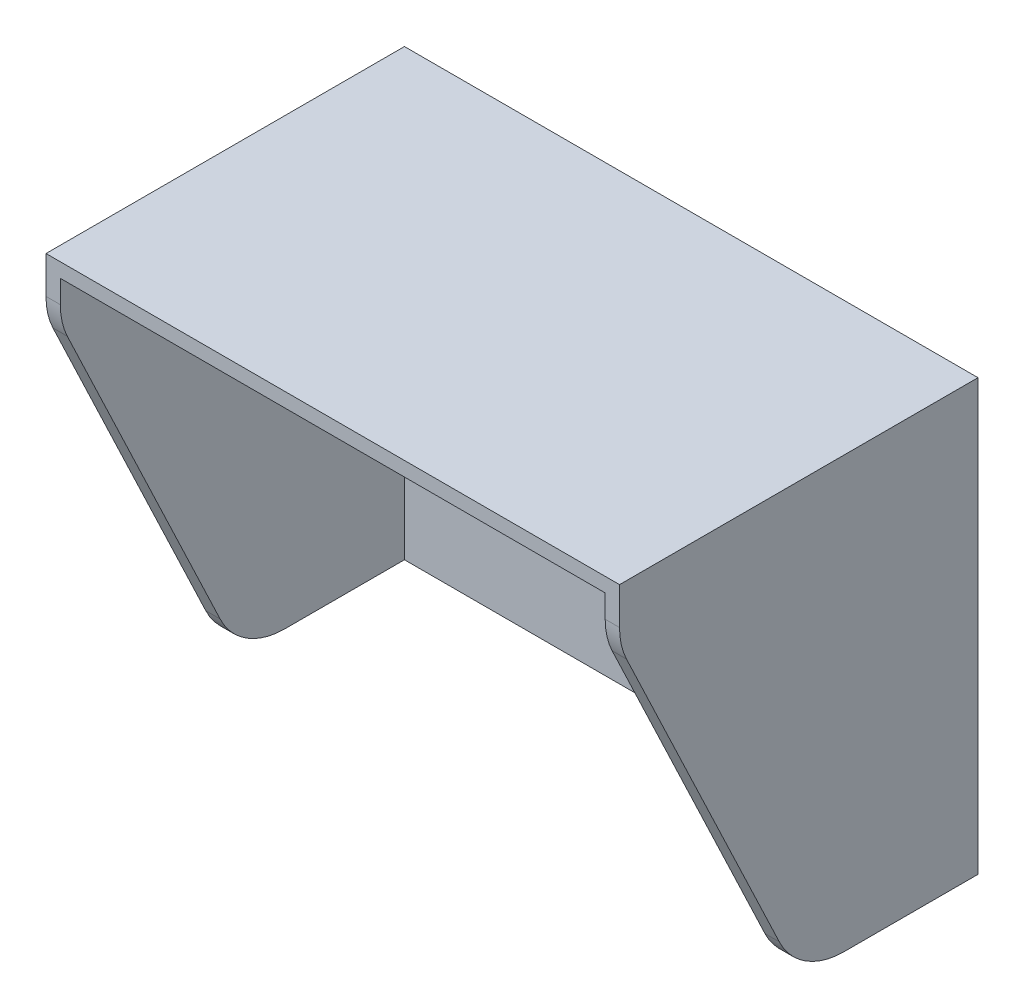
ISO-10303-21;
HEADER;
FILE_DESCRIPTION(('STEP AP214'),'2;1');
FILE_NAME('part.step','',(''),(''),'','','');
FILE_SCHEMA(('AUTOMOTIVE_DESIGN { 1 0 10303 214 1 1 1 1 }'));
ENDSEC;
DATA;
#1=APPLICATION_CONTEXT('core data for automotive mechanical design processes');
#2=APPLICATION_PROTOCOL_DEFINITION('international standard','automotive_design',2000,#1);
#3=PRODUCT_CONTEXT('',#1,'mechanical');
#4=PRODUCT('Part','Part','',(#3));
#5=PRODUCT_RELATED_PRODUCT_CATEGORY('part','',(#4));
#6=PRODUCT_DEFINITION_FORMATION('','',#4);
#7=PRODUCT_DEFINITION_CONTEXT('part definition',#1,'design');
#8=PRODUCT_DEFINITION('design','',#6,#7);
#9=PRODUCT_DEFINITION_SHAPE('','',#8);
#10=(LENGTH_UNIT() NAMED_UNIT(*) SI_UNIT(.MILLI.,.METRE.));
#11=(NAMED_UNIT(*) PLANE_ANGLE_UNIT() SI_UNIT($,.RADIAN.));
#12=(NAMED_UNIT(*) SI_UNIT($,.STERADIAN.) SOLID_ANGLE_UNIT());
#13=UNCERTAINTY_MEASURE_WITH_UNIT(LENGTH_MEASURE(1.E-05),#10,'distance_accuracy_value','');
#14=(GEOMETRIC_REPRESENTATION_CONTEXT(3) GLOBAL_UNCERTAINTY_ASSIGNED_CONTEXT((#13)) GLOBAL_UNIT_ASSIGNED_CONTEXT((#10,
#11,#12)) REPRESENTATION_CONTEXT('',''));
#15=CARTESIAN_POINT('',(0.,0.,0.));
#16=DIRECTION('',(0.,0.,1.));
#17=DIRECTION('',(1.,0.,0.));
#18=AXIS2_PLACEMENT_3D('',#15,#16,#17);
#19=CARTESIAN_POINT('',(0.,0.,50.));
#20=DIRECTION('',(0.,0.,1.));
#21=DIRECTION('',(1.,0.,0.));
#22=AXIS2_PLACEMENT_3D('',#19,#20,#21);
#23=PLANE('',#22);
#24=DIRECTION('',(0.,1.,0.));
#25=VECTOR('',#24,1.);
#26=CARTESIAN_POINT('',(29.0064520376589,-21.6961946145236,50.));
#27=LINE('',#26,#25);
#28=CARTESIAN_POINT('',(29.0064520376589,33.1212483638672,50.));
#29=VERTEX_POINT('',#28);
#30=CARTESIAN_POINT('',(29.0064520376589,36.3038053854764,50.));
#31=VERTEX_POINT('',#30);
#32=EDGE_CURVE('E313',#29,#31,#27,.T.);
#33=ORIENTED_EDGE('',*,*,#32,.F.);
#34=DIRECTION('',(-1.,0.,0.));
#35=VECTOR('',#34,1.);
#36=CARTESIAN_POINT('',(31.0064520376589,33.1212483638672,50.));
#37=LINE('',#36,#35);
#38=CARTESIAN_POINT('',(31.0064520376588,33.1212483638672,50.));
#39=VERTEX_POINT('',#38);
#40=EDGE_CURVE('E256',#29,#39,#37,.F.);
#41=ORIENTED_EDGE('',*,*,#40,.T.);
#42=DIRECTION('',(0.,1.,0.));
#43=VECTOR('',#42,1.);
#44=CARTESIAN_POINT('',(31.0064520376588,38.3038053854764,50.));
#45=LINE('',#44,#43);
#46=CARTESIAN_POINT('',(31.0064520376588,38.3038053854764,50.));
#47=VERTEX_POINT('',#46);
#48=EDGE_CURVE('E201',#39,#47,#45,.T.);
#49=ORIENTED_EDGE('',*,*,#48,.T.);
#50=DIRECTION('',(-1.,0.,0.));
#51=VECTOR('',#50,1.);
#52=CARTESIAN_POINT('',(-48.9935479623412,38.3038053854764,50.));
#53=LINE('',#52,#51);
#54=CARTESIAN_POINT('',(-48.9935479623412,38.3038053854764,50.));
#55=VERTEX_POINT('',#54);
#56=EDGE_CURVE('E205',#47,#55,#53,.T.);
#57=ORIENTED_EDGE('',*,*,#56,.T.);
#58=DIRECTION('',(0.,-1.,0.));
#59=VECTOR('',#58,1.);
#60=CARTESIAN_POINT('',(-48.9935479623412,38.3038053854764,50.));
#61=LINE('',#60,#59);
#62=CARTESIAN_POINT('',(-48.9935479623412,33.1212483638672,50.));
#63=VERTEX_POINT('',#62);
#64=EDGE_CURVE('E197',#55,#63,#61,.T.);
#65=ORIENTED_EDGE('',*,*,#64,.T.);
#66=DIRECTION('',(-1.,0.,0.));
#67=VECTOR('',#66,1.);
#68=CARTESIAN_POINT('',(-46.9935479623412,33.1212483638672,50.));
#69=LINE('',#68,#67);
#70=CARTESIAN_POINT('',(-46.9935479623412,33.1212483638672,50.));
#71=VERTEX_POINT('',#70);
#72=EDGE_CURVE('E253',#63,#71,#69,.F.);
#73=ORIENTED_EDGE('',*,*,#72,.T.);
#74=DIRECTION('',(0.,-1.,0.));
#75=VECTOR('',#74,1.);
#76=CARTESIAN_POINT('',(-46.9935479623412,-21.6961946145236,50.));
#77=LINE('',#76,#75);
#78=CARTESIAN_POINT('',(-46.9935479623412,36.3038053854764,50.));
#79=VERTEX_POINT('',#78);
#80=EDGE_CURVE('E321',#79,#71,#77,.T.);
#81=ORIENTED_EDGE('',*,*,#80,.F.);
#82=DIRECTION('',(-1.,0.,0.));
#83=VECTOR('',#82,1.);
#84=CARTESIAN_POINT('',(-46.9935479623412,36.3038053854764,50.));
#85=LINE('',#84,#83);
#86=EDGE_CURVE('E319',#31,#79,#85,.T.);
#87=ORIENTED_EDGE('',*,*,#86,.F.);
#88=EDGE_LOOP('',(#33,#41,#49,#57,#65,#73,#81,#87));
#89=FACE_BOUND('',#88,.T.);
#90=ADVANCED_FACE('F43',(#89),#23,.T.);
#91=CARTESIAN_POINT('',(0.,0.,0.));
#92=DIRECTION('',(0.,0.,1.));
#93=DIRECTION('',(1.,0.,0.));
#94=AXIS2_PLACEMENT_3D('',#91,#92,#93);
#95=PLANE('',#94);
#96=DIRECTION('',(0.,-1.,0.));
#97=VECTOR('',#96,1.);
#98=CARTESIAN_POINT('',(-48.9935479623412,38.3038053854764,0.));
#99=LINE('',#98,#97);
#100=CARTESIAN_POINT('',(-48.9935479623412,38.3038053854764,0.));
#101=VERTEX_POINT('',#100);
#102=CARTESIAN_POINT('',(-48.9935479623411,-21.6961946145236,0.));
#103=VERTEX_POINT('',#102);
#104=EDGE_CURVE('E196',#101,#103,#99,.T.);
#105=ORIENTED_EDGE('',*,*,#104,.F.);
#106=DIRECTION('',(-1.,0.,0.));
#107=VECTOR('',#106,1.);
#108=CARTESIAN_POINT('',(-48.9935479623412,38.3038053854764,0.));
#109=LINE('',#108,#107);
#110=CARTESIAN_POINT('',(31.0064520376588,38.3038053854764,0.));
#111=VERTEX_POINT('',#110);
#112=EDGE_CURVE('E202',#111,#101,#109,.T.);
#113=ORIENTED_EDGE('',*,*,#112,.F.);
#114=DIRECTION('',(0.,1.,0.));
#115=VECTOR('',#114,1.);
#116=CARTESIAN_POINT('',(31.0064520376588,38.3038053854764,0.));
#117=LINE('',#116,#115);
#118=CARTESIAN_POINT('',(31.0064520376589,-21.6961946145236,0.));
#119=VERTEX_POINT('',#118);
#120=EDGE_CURVE('E216',#119,#111,#117,.T.);
#121=ORIENTED_EDGE('',*,*,#120,.F.);
#122=DIRECTION('',(1.,0.,0.));
#123=VECTOR('',#122,1.);
#124=CARTESIAN_POINT('',(-48.9935479623411,-21.6961946145236,0.));
#125=LINE('',#124,#123);
#126=EDGE_CURVE('E212',#103,#119,#125,.T.);
#127=ORIENTED_EDGE('',*,*,#126,.F.);
#128=EDGE_LOOP('',(#105,#113,#121,#127));
#129=FACE_BOUND('',#128,.T.);
#130=CARTESIAN_POINT('',(3.50645203765886,-1.69619461452365,0.));
#131=DIRECTION('',(0.,0.,1.));
#132=DIRECTION('',(1.,0.,0.));
#133=AXIS2_PLACEMENT_3D('',#130,#131,#132);
#134=CIRCLE('',#133,1.6);
#135=CARTESIAN_POINT('',(5.10645203765886,-1.69619461452365,0.));
#136=VERTEX_POINT('',#135);
#137=EDGE_CURVE('E192',#136,#136,#134,.T.);
#138=ORIENTED_EDGE('',*,*,#137,.T.);
#139=EDGE_LOOP('',(#138));
#140=FACE_BOUND('',#139,.T.);
#141=CARTESIAN_POINT('',(18.5064520376589,-1.69619461452365,0.));
#142=DIRECTION('',(0.,0.,1.));
#143=DIRECTION('',(1.,0.,0.));
#144=AXIS2_PLACEMENT_3D('',#141,#142,#143);
#145=CIRCLE('',#144,1.6);
#146=CARTESIAN_POINT('',(20.1064520376589,-1.69619461452365,0.));
#147=VERTEX_POINT('',#146);
#148=EDGE_CURVE('E187',#147,#147,#145,.T.);
#149=ORIENTED_EDGE('',*,*,#148,.T.);
#150=EDGE_LOOP('',(#149));
#151=FACE_BOUND('',#150,.T.);
#152=ADVANCED_FACE('F293',(#129,#140,#151),#95,.F.);
#153=CARTESIAN_POINT('',(-48.9935479623412,38.3038053854764,50.));
#154=DIRECTION('',(1.,0.,0.));
#155=DIRECTION('',(0.,1.,0.));
#156=AXIS2_PLACEMENT_3D('',#153,#154,#155);
#157=PLANE('',#156);
#158=DIRECTION('',(0.,-0.903052185817531,-0.429530848356877));
#159=VECTOR('',#158,1.);
#160=CARTESIAN_POINT('',(-48.9935479623412,30.8641854648151,50.));
#161=LINE('',#160,#159);
#162=CARTESIAN_POINT('',(-48.9935479623412,28.8259398802984,49.0305218581753));
#163=VERTEX_POINT('',#162);
#164=CARTESIAN_POINT('',(-48.9935479623411,-15.9915030980924,27.7133990982467));
#165=VERTEX_POINT('',#164);
#166=EDGE_CURVE('E345',#163,#165,#161,.T.);
#167=ORIENTED_EDGE('',*,*,#166,.F.);
#168=CARTESIAN_POINT('',(-48.9935479623412,33.1212483638672,40.));
#169=DIRECTION('',(1.,0.,0.));
#170=DIRECTION('',(0.,1.,0.));
#171=AXIS2_PLACEMENT_3D('',#168,#169,#170);
#172=CIRCLE('',#171,10.);
#173=EDGE_CURVE('E274',#163,#63,#172,.F.);
#174=ORIENTED_EDGE('',*,*,#173,.T.);
#175=ORIENTED_EDGE('',*,*,#64,.F.);
#176=DIRECTION('',(0.,0.,-1.));
#177=VECTOR('',#176,1.);
#178=CARTESIAN_POINT('',(-48.9935479623412,38.3038053854764,50.));
#179=LINE('',#178,#177);
#180=EDGE_CURVE('E208',#55,#101,#179,.T.);
#181=ORIENTED_EDGE('',*,*,#180,.T.);
#182=ORIENTED_EDGE('',*,*,#104,.T.);
#183=DIRECTION('',(0.,0.,-1.));
#184=VECTOR('',#183,1.);
#185=CARTESIAN_POINT('',(-48.9935479623411,-21.6961946145236,50.));
#186=LINE('',#185,#184);
#187=CARTESIAN_POINT('',(-48.9935479623411,-21.6961946145236,18.6828772400714));
#188=VERTEX_POINT('',#187);
#189=EDGE_CURVE('E231',#188,#103,#186,.T.);
#190=ORIENTED_EDGE('',*,*,#189,.F.);
#191=CARTESIAN_POINT('',(-48.9935479623411,-11.6961946145236,18.6828772400714));
#192=DIRECTION('',(1.,0.,0.));
#193=DIRECTION('',(0.,1.,0.));
#194=AXIS2_PLACEMENT_3D('',#191,#192,#193);
#195=CIRCLE('',#194,10.);
#196=EDGE_CURVE('E67',#188,#165,#195,.F.);
#197=ORIENTED_EDGE('',*,*,#196,.T.);
#198=EDGE_LOOP('',(#167,#174,#175,#181,#182,#190,#197));
#199=FACE_BOUND('',#198,.T.);
#200=ADVANCED_FACE('F286',(#199),#157,.F.);
#201=CARTESIAN_POINT('',(-48.9935479623411,-21.6961946145236,50.));
#202=DIRECTION('',(0.,1.,0.));
#203=DIRECTION('',(0.,0.,1.));
#204=AXIS2_PLACEMENT_3D('',#201,#202,#203);
#205=PLANE('',#204);
#206=DIRECTION('',(0.,0.,-1.));
#207=VECTOR('',#206,1.);
#208=CARTESIAN_POINT('',(31.0064520376589,-21.6961946145236,50.));
#209=LINE('',#208,#207);
#210=CARTESIAN_POINT('',(31.0064520376589,-21.6961946145236,18.6828772400714));
#211=VERTEX_POINT('',#210);
#212=EDGE_CURVE('E228',#211,#119,#209,.T.);
#213=ORIENTED_EDGE('',*,*,#212,.F.);
#214=DIRECTION('',(-1.,0.,0.));
#215=VECTOR('',#214,1.);
#216=CARTESIAN_POINT('',(-48.9935479623411,-21.6961946145236,18.6828772400714));
#217=LINE('',#216,#215);
#218=CARTESIAN_POINT('',(29.0064520376589,-21.6961946145236,18.6828772400714));
#219=VERTEX_POINT('',#218);
#220=EDGE_CURVE('E11',#211,#219,#217,.T.);
#221=ORIENTED_EDGE('',*,*,#220,.T.);
#222=DIRECTION('',(0.,0.,1.));
#223=VECTOR('',#222,1.);
#224=CARTESIAN_POINT('',(29.0064520376589,-21.6961946145236,2.));
#225=LINE('',#224,#223);
#226=CARTESIAN_POINT('',(29.0064520376589,-21.6961946145236,2.));
#227=VERTEX_POINT('',#226);
#228=EDGE_CURVE('E153',#227,#219,#225,.T.);
#229=ORIENTED_EDGE('',*,*,#228,.F.);
#230=DIRECTION('',(1.,0.,0.));
#231=VECTOR('',#230,1.);
#232=CARTESIAN_POINT('',(-46.9935479623412,-21.6961946145236,2.));
#233=LINE('',#232,#231);
#234=CARTESIAN_POINT('',(-46.9935479623412,-21.6961946145236,2.));
#235=VERTEX_POINT('',#234);
#236=EDGE_CURVE('E161',#235,#227,#233,.T.);
#237=ORIENTED_EDGE('',*,*,#236,.F.);
#238=DIRECTION('',(0.,0.,1.));
#239=VECTOR('',#238,1.);
#240=CARTESIAN_POINT('',(-46.9935479623412,-21.6961946145236,2.));
#241=LINE('',#240,#239);
#242=CARTESIAN_POINT('',(-46.9935479623412,-21.6961946145236,18.6828772400714));
#243=VERTEX_POINT('',#242);
#244=EDGE_CURVE('E174',#235,#243,#241,.T.);
#245=ORIENTED_EDGE('',*,*,#244,.T.);
#246=DIRECTION('',(-1.,0.,0.));
#247=VECTOR('',#246,1.);
#248=CARTESIAN_POINT('',(-48.9935479623411,-21.6961946145236,18.6828772400714));
#249=LINE('',#248,#247);
#250=EDGE_CURVE('E52',#243,#188,#249,.T.);
#251=ORIENTED_EDGE('',*,*,#250,.T.);
#252=ORIENTED_EDGE('',*,*,#189,.T.);
#253=ORIENTED_EDGE('',*,*,#126,.T.);
#254=EDGE_LOOP('',(#213,#221,#229,#237,#245,#251,#252,#253));
#255=FACE_BOUND('',#254,.T.);
#256=ADVANCED_FACE('F171',(#255),#205,.F.);
#257=CARTESIAN_POINT('',(31.0064520376588,38.3038053854764,50.));
#258=DIRECTION('',(-1.,0.,0.));
#259=DIRECTION('',(0.,-1.,0.));
#260=AXIS2_PLACEMENT_3D('',#257,#258,#259);
#261=PLANE('',#260);
#262=ORIENTED_EDGE('',*,*,#48,.F.);
#263=CARTESIAN_POINT('',(31.0064520376588,33.1212483638672,40.));
#264=DIRECTION('',(-1.,0.,0.));
#265=DIRECTION('',(0.,-1.,0.));
#266=AXIS2_PLACEMENT_3D('',#263,#264,#265);
#267=CIRCLE('',#266,10.);
#268=CARTESIAN_POINT('',(31.0064520376589,28.8259398802984,49.0305218581753));
#269=VERTEX_POINT('',#268);
#270=EDGE_CURVE('E262',#39,#269,#267,.F.);
#271=ORIENTED_EDGE('',*,*,#270,.T.);
#272=DIRECTION('',(0.,-0.903052185817531,-0.429530848356877));
#273=VECTOR('',#272,1.);
#274=CARTESIAN_POINT('',(31.0064520376589,30.8641854648151,50.));
#275=LINE('',#274,#273);
#276=CARTESIAN_POINT('',(31.0064520376589,-15.9915030980924,27.7133990982467));
#277=VERTEX_POINT('',#276);
#278=EDGE_CURVE('E307',#269,#277,#275,.T.);
#279=ORIENTED_EDGE('',*,*,#278,.T.);
#280=CARTESIAN_POINT('',(31.0064520376589,-11.6961946145236,18.6828772400714));
#281=DIRECTION('',(-1.,0.,0.));
#282=DIRECTION('',(0.,-1.,0.));
#283=AXIS2_PLACEMENT_3D('',#280,#281,#282);
#284=CIRCLE('',#283,10.);
#285=EDGE_CURVE('E259',#277,#211,#284,.F.);
#286=ORIENTED_EDGE('',*,*,#285,.T.);
#287=ORIENTED_EDGE('',*,*,#212,.T.);
#288=ORIENTED_EDGE('',*,*,#120,.T.);
#289=DIRECTION('',(0.,0.,-1.));
#290=VECTOR('',#289,1.);
#291=CARTESIAN_POINT('',(31.0064520376588,38.3038053854764,50.));
#292=LINE('',#291,#290);
#293=EDGE_CURVE('E224',#47,#111,#292,.T.);
#294=ORIENTED_EDGE('',*,*,#293,.F.);
#295=EDGE_LOOP('',(#262,#271,#279,#286,#287,#288,#294));
#296=FACE_BOUND('',#295,.T.);
#297=ADVANCED_FACE('F369',(#296),#261,.F.);
#298=CARTESIAN_POINT('',(-48.9935479623412,38.3038053854764,50.));
#299=DIRECTION('',(0.,-1.,0.));
#300=DIRECTION('',(0.,0.,-1.));
#301=AXIS2_PLACEMENT_3D('',#298,#299,#300);
#302=PLANE('',#301);
#303=ORIENTED_EDGE('',*,*,#112,.T.);
#304=ORIENTED_EDGE('',*,*,#180,.F.);
#305=ORIENTED_EDGE('',*,*,#56,.F.);
#306=ORIENTED_EDGE('',*,*,#293,.T.);
#307=EDGE_LOOP('',(#303,#304,#305,#306));
#308=FACE_BOUND('',#307,.T.);
#309=ADVANCED_FACE('F366',(#308),#302,.F.);
#310=CARTESIAN_POINT('',(3.50645203765886,-1.69619461452365,50.));
#311=DIRECTION('',(0.,0.,-1.));
#312=DIRECTION('',(-1.,0.,0.));
#313=AXIS2_PLACEMENT_3D('',#310,#311,#312);
#314=CYLINDRICAL_SURFACE('',#313,1.6);
#315=CARTESIAN_POINT('',(3.50645203765886,-1.69619461452365,2.));
#316=DIRECTION('',(0.,0.,-1.));
#317=DIRECTION('',(-1.,0.,0.));
#318=AXIS2_PLACEMENT_3D('',#315,#316,#317);
#319=CIRCLE('',#318,1.6);
#320=CARTESIAN_POINT('',(1.90645203765886,-1.69619461452365,2.));
#321=VERTEX_POINT('',#320);
#322=EDGE_CURVE('E183',#321,#321,#319,.T.);
#323=ORIENTED_EDGE('',*,*,#322,.F.);
#324=EDGE_LOOP('',(#323));
#325=FACE_BOUND('',#324,.T.);
#326=ORIENTED_EDGE('',*,*,#137,.F.);
#327=EDGE_LOOP('',(#326));
#328=FACE_BOUND('',#327,.T.);
#329=ADVANCED_FACE('F363',(#325,#328),#314,.F.);
#330=CARTESIAN_POINT('',(18.5064520376589,-1.69619461452365,50.));
#331=DIRECTION('',(0.,0.,-1.));
#332=DIRECTION('',(-1.,0.,0.));
#333=AXIS2_PLACEMENT_3D('',#330,#331,#332);
#334=CYLINDRICAL_SURFACE('',#333,1.6);
#335=CARTESIAN_POINT('',(18.5064520376589,-1.69619461452365,2.));
#336=DIRECTION('',(0.,0.,-1.));
#337=DIRECTION('',(-1.,0.,0.));
#338=AXIS2_PLACEMENT_3D('',#335,#336,#337);
#339=CIRCLE('',#338,1.6);
#340=CARTESIAN_POINT('',(16.9064520376589,-1.69619461452365,2.));
#341=VERTEX_POINT('',#340);
#342=EDGE_CURVE('E188',#341,#341,#339,.T.);
#343=ORIENTED_EDGE('',*,*,#342,.F.);
#344=EDGE_LOOP('',(#343));
#345=FACE_BOUND('',#344,.T.);
#346=ORIENTED_EDGE('',*,*,#148,.F.);
#347=EDGE_LOOP('',(#346));
#348=FACE_BOUND('',#347,.T.);
#349=ADVANCED_FACE('F454',(#345,#348),#334,.F.);
#350=CARTESIAN_POINT('',(-46.9935479623412,-21.6961946145236,2.));
#351=DIRECTION('',(-1.,0.,0.));
#352=DIRECTION('',(0.,0.,1.));
#353=AXIS2_PLACEMENT_3D('',#350,#351,#352);
#354=PLANE('',#353);
#355=ORIENTED_EDGE('',*,*,#80,.T.);
#356=CARTESIAN_POINT('',(-46.9935479623412,33.1212483638672,40.));
#357=DIRECTION('',(-1.,0.,0.));
#358=DIRECTION('',(0.,0.,1.));
#359=AXIS2_PLACEMENT_3D('',#356,#357,#358);
#360=CIRCLE('',#359,10.);
#361=CARTESIAN_POINT('',(-46.9935479623412,28.8259398802985,49.0305218581753));
#362=VERTEX_POINT('',#361);
#363=EDGE_CURVE('E279',#71,#362,#360,.F.);
#364=ORIENTED_EDGE('',*,*,#363,.T.);
#365=DIRECTION('',(0.,-0.903052185817532,-0.429530848356877));
#366=VECTOR('',#365,1.);
#367=CARTESIAN_POINT('',(-46.9935479623412,-30.6176363586726,20.7565747571259));
#368=LINE('',#367,#366);
#369=CARTESIAN_POINT('',(-46.9935479623412,-15.9915030980924,27.7133990982467));
#370=VERTEX_POINT('',#369);
#371=EDGE_CURVE('E327',#362,#370,#368,.T.);
#372=ORIENTED_EDGE('',*,*,#371,.T.);
#373=CARTESIAN_POINT('',(-46.9935479623412,-11.6961946145236,18.6828772400714));
#374=DIRECTION('',(-1.,0.,0.));
#375=DIRECTION('',(0.,0.,1.));
#376=AXIS2_PLACEMENT_3D('',#373,#374,#375);
#377=CIRCLE('',#376,10.);
#378=EDGE_CURVE('E59',#370,#243,#377,.F.);
#379=ORIENTED_EDGE('',*,*,#378,.T.);
#380=ORIENTED_EDGE('',*,*,#244,.F.);
#381=DIRECTION('',(0.,-1.,0.));
#382=VECTOR('',#381,1.);
#383=CARTESIAN_POINT('',(-46.9935479623412,-21.6961946145236,2.));
#384=LINE('',#383,#382);
#385=CARTESIAN_POINT('',(-46.9935479623412,36.3038053854764,2.));
#386=VERTEX_POINT('',#385);
#387=EDGE_CURVE('E166',#386,#235,#384,.T.);
#388=ORIENTED_EDGE('',*,*,#387,.F.);
#389=DIRECTION('',(0.,0.,1.));
#390=VECTOR('',#389,1.);
#391=CARTESIAN_POINT('',(-46.9935479623412,36.3038053854764,2.));
#392=LINE('',#391,#390);
#393=EDGE_CURVE('E178',#386,#79,#392,.T.);
#394=ORIENTED_EDGE('',*,*,#393,.T.);
#395=EDGE_LOOP('',(#355,#364,#372,#379,#380,#388,#394));
#396=FACE_BOUND('',#395,.T.);
#397=ADVANCED_FACE('F331',(#396),#354,.F.);
#398=CARTESIAN_POINT('',(-46.9935479623412,36.3038053854764,2.));
#399=DIRECTION('',(0.,1.,0.));
#400=DIRECTION('',(0.,0.,1.));
#401=AXIS2_PLACEMENT_3D('',#398,#399,#400);
#402=PLANE('',#401);
#403=ORIENTED_EDGE('',*,*,#86,.T.);
#404=ORIENTED_EDGE('',*,*,#393,.F.);
#405=DIRECTION('',(-1.,0.,0.));
#406=VECTOR('',#405,1.);
#407=CARTESIAN_POINT('',(-46.9935479623412,36.3038053854764,2.));
#408=LINE('',#407,#406);
#409=CARTESIAN_POINT('',(29.0064520376589,36.3038053854764,2.));
#410=VERTEX_POINT('',#409);
#411=EDGE_CURVE('E160',#410,#386,#408,.T.);
#412=ORIENTED_EDGE('',*,*,#411,.F.);
#413=DIRECTION('',(0.,0.,1.));
#414=VECTOR('',#413,1.);
#415=CARTESIAN_POINT('',(29.0064520376589,36.3038053854764,2.));
#416=LINE('',#415,#414);
#417=EDGE_CURVE('E155',#410,#31,#416,.T.);
#418=ORIENTED_EDGE('',*,*,#417,.T.);
#419=EDGE_LOOP('',(#403,#404,#412,#418));
#420=FACE_BOUND('',#419,.T.);
#421=ADVANCED_FACE('F334',(#420),#402,.F.);
#422=CARTESIAN_POINT('',(29.0064520376589,-21.6961946145236,2.));
#423=DIRECTION('',(1.,0.,0.));
#424=DIRECTION('',(0.,0.,-1.));
#425=AXIS2_PLACEMENT_3D('',#422,#423,#424);
#426=PLANE('',#425);
#427=DIRECTION('',(0.,0.903052185817532,0.429530848356877));
#428=VECTOR('',#427,1.);
#429=CARTESIAN_POINT('',(29.0064520376589,-30.6176363586726,20.7565747571259));
#430=LINE('',#429,#428);
#431=CARTESIAN_POINT('',(29.0064520376589,-15.9915030980924,27.7133990982467));
#432=VERTEX_POINT('',#431);
#433=CARTESIAN_POINT('',(29.0064520376589,28.8259398802985,49.0305218581753));
#434=VERTEX_POINT('',#433);
#435=EDGE_CURVE('E234',#432,#434,#430,.T.);
#436=ORIENTED_EDGE('',*,*,#435,.T.);
#437=CARTESIAN_POINT('',(29.0064520376589,33.1212483638672,40.));
#438=DIRECTION('',(1.,0.,0.));
#439=DIRECTION('',(0.,0.,-1.));
#440=AXIS2_PLACEMENT_3D('',#437,#438,#439);
#441=CIRCLE('',#440,10.);
#442=EDGE_CURVE('E250',#434,#29,#441,.F.);
#443=ORIENTED_EDGE('',*,*,#442,.T.);
#444=ORIENTED_EDGE('',*,*,#32,.T.);
#445=ORIENTED_EDGE('',*,*,#417,.F.);
#446=DIRECTION('',(0.,1.,0.));
#447=VECTOR('',#446,1.);
#448=CARTESIAN_POINT('',(29.0064520376589,-21.6961946145236,2.));
#449=LINE('',#448,#447);
#450=EDGE_CURVE('E148',#227,#410,#449,.T.);
#451=ORIENTED_EDGE('',*,*,#450,.F.);
#452=ORIENTED_EDGE('',*,*,#228,.T.);
#453=CARTESIAN_POINT('',(29.0064520376589,-11.6961946145236,18.6828772400714));
#454=DIRECTION('',(1.,0.,0.));
#455=DIRECTION('',(0.,0.,-1.));
#456=AXIS2_PLACEMENT_3D('',#453,#454,#455);
#457=CIRCLE('',#456,10.);
#458=EDGE_CURVE('E247',#219,#432,#457,.F.);
#459=ORIENTED_EDGE('',*,*,#458,.T.);
#460=EDGE_LOOP('',(#436,#443,#444,#445,#451,#452,#459));
#461=FACE_BOUND('',#460,.T.);
#462=ADVANCED_FACE('F151',(#461),#426,.F.);
#463=CARTESIAN_POINT('',(0.,0.,2.));
#464=DIRECTION('',(0.,0.,-1.));
#465=DIRECTION('',(-1.,0.,0.));
#466=AXIS2_PLACEMENT_3D('',#463,#464,#465);
#467=PLANE('',#466);
#468=ORIENTED_EDGE('',*,*,#322,.T.);
#469=EDGE_LOOP('',(#468));
#470=FACE_BOUND('',#469,.T.);
#471=ORIENTED_EDGE('',*,*,#342,.T.);
#472=EDGE_LOOP('',(#471));
#473=FACE_BOUND('',#472,.T.);
#474=ORIENTED_EDGE('',*,*,#387,.T.);
#475=ORIENTED_EDGE('',*,*,#236,.T.);
#476=ORIENTED_EDGE('',*,*,#450,.T.);
#477=ORIENTED_EDGE('',*,*,#411,.T.);
#478=EDGE_LOOP('',(#474,#475,#476,#477));
#479=FACE_BOUND('',#478,.T.);
#480=ADVANCED_FACE('F164',(#470,#473,#479),#467,.F.);
#481=CARTESIAN_POINT('',(31.0064520376589,30.8641854648151,50.));
#482=DIRECTION('',(0.,0.429530848356877,-0.903052185817531));
#483=DIRECTION('',(0.,0.903052185817532,0.429530848356877));
#484=AXIS2_PLACEMENT_3D('',#481,#482,#483);
#485=PLANE('',#484);
#486=ORIENTED_EDGE('',*,*,#278,.F.);
#487=DIRECTION('',(-1.,0.,0.));
#488=VECTOR('',#487,1.);
#489=CARTESIAN_POINT('',(29.0064520376589,28.8259398802984,49.0305218581753));
#490=LINE('',#489,#488);
#491=EDGE_CURVE('E243',#269,#434,#490,.T.);
#492=ORIENTED_EDGE('',*,*,#491,.T.);
#493=ORIENTED_EDGE('',*,*,#435,.F.);
#494=DIRECTION('',(-1.,0.,0.));
#495=VECTOR('',#494,1.);
#496=CARTESIAN_POINT('',(31.0064520376589,-15.9915030980924,27.7133990982467));
#497=LINE('',#496,#495);
#498=EDGE_CURVE('E240',#432,#277,#497,.F.);
#499=ORIENTED_EDGE('',*,*,#498,.T.);
#500=EDGE_LOOP('',(#486,#492,#493,#499));
#501=FACE_BOUND('',#500,.T.);
#502=ADVANCED_FACE('F304',(#501),#485,.F.);
#503=ORIENTED_EDGE('',*,*,#371,.F.);
#504=DIRECTION('',(-1.,0.,0.));
#505=VECTOR('',#504,1.);
#506=CARTESIAN_POINT('',(-48.9935479623412,28.8259398802984,49.0305218581753));
#507=LINE('',#506,#505);
#508=EDGE_CURVE('E268',#362,#163,#507,.T.);
#509=ORIENTED_EDGE('',*,*,#508,.T.);
#510=ORIENTED_EDGE('',*,*,#166,.T.);
#511=DIRECTION('',(-1.,0.,0.));
#512=VECTOR('',#511,1.);
#513=CARTESIAN_POINT('',(31.0064520376589,-15.9915030980924,27.7133990982467));
#514=LINE('',#513,#512);
#515=EDGE_CURVE('E265',#165,#370,#514,.F.);
#516=ORIENTED_EDGE('',*,*,#515,.T.);
#517=EDGE_LOOP('',(#503,#509,#510,#516));
#518=FACE_BOUND('',#517,.T.);
#519=ADVANCED_FACE('F341',(#518),#485,.F.);
#520=CARTESIAN_POINT('',(31.0064520376589,33.1212483638672,40.));
#521=DIRECTION('',(1.,0.,0.));
#522=DIRECTION('',(0.,1.,0.));
#523=AXIS2_PLACEMENT_3D('',#520,#521,#522);
#524=CYLINDRICAL_SURFACE('',#523,10.);
#525=ORIENTED_EDGE('',*,*,#270,.F.);
#526=ORIENTED_EDGE('',*,*,#40,.F.);
#527=ORIENTED_EDGE('',*,*,#442,.F.);
#528=ORIENTED_EDGE('',*,*,#491,.F.);
#529=EDGE_LOOP('',(#525,#526,#527,#528));
#530=FACE_BOUND('',#529,.T.);
#531=ADVANCED_FACE('F310',(#530),#524,.T.);
#532=CARTESIAN_POINT('',(31.0064520376589,33.1212483638672,40.));
#533=DIRECTION('',(1.,0.,0.));
#534=DIRECTION('',(0.,1.,0.));
#535=AXIS2_PLACEMENT_3D('',#532,#533,#534);
#536=CYLINDRICAL_SURFACE('',#535,10.);
#537=ORIENTED_EDGE('',*,*,#363,.F.);
#538=ORIENTED_EDGE('',*,*,#72,.F.);
#539=ORIENTED_EDGE('',*,*,#173,.F.);
#540=ORIENTED_EDGE('',*,*,#508,.F.);
#541=EDGE_LOOP('',(#537,#538,#539,#540));
#542=FACE_BOUND('',#541,.T.);
#543=ADVANCED_FACE('F337',(#542),#536,.T.);
#544=CARTESIAN_POINT('',(-48.9935479623411,-11.6961946145236,18.6828772400714));
#545=DIRECTION('',(-1.,0.,0.));
#546=DIRECTION('',(0.,0.,1.));
#547=AXIS2_PLACEMENT_3D('',#544,#545,#546);
#548=CYLINDRICAL_SURFACE('',#547,10.);
#549=ORIENTED_EDGE('',*,*,#285,.F.);
#550=ORIENTED_EDGE('',*,*,#498,.F.);
#551=ORIENTED_EDGE('',*,*,#458,.F.);
#552=ORIENTED_EDGE('',*,*,#220,.F.);
#553=EDGE_LOOP('',(#549,#550,#551,#552));
#554=FACE_BOUND('',#553,.T.);
#555=ADVANCED_FACE('F299',(#554),#548,.T.);
#556=CARTESIAN_POINT('',(-48.9935479623411,-11.6961946145236,18.6828772400714));
#557=DIRECTION('',(-1.,0.,0.));
#558=DIRECTION('',(0.,0.,1.));
#559=AXIS2_PLACEMENT_3D('',#556,#557,#558);
#560=CYLINDRICAL_SURFACE('',#559,10.);
#561=ORIENTED_EDGE('',*,*,#378,.F.);
#562=ORIENTED_EDGE('',*,*,#515,.F.);
#563=ORIENTED_EDGE('',*,*,#196,.F.);
#564=ORIENTED_EDGE('',*,*,#250,.F.);
#565=EDGE_LOOP('',(#561,#562,#563,#564));
#566=FACE_BOUND('',#565,.T.);
#567=ADVANCED_FACE('F45',(#566),#560,.T.);
#568=CLOSED_SHELL('',(#90,#152,#200,#256,#297,#309,#329,#349,#397,#421,#462,#480,#502,#519,#531,
#543,#555,#567));
#569=MANIFOLD_SOLID_BREP('B2',#568);
#570=ADVANCED_BREP_SHAPE_REPRESENTATION('',(#18,#569),#14);
#571=SHAPE_DEFINITION_REPRESENTATION(#9,#570);
ENDSEC;
END-ISO-10303-21;
